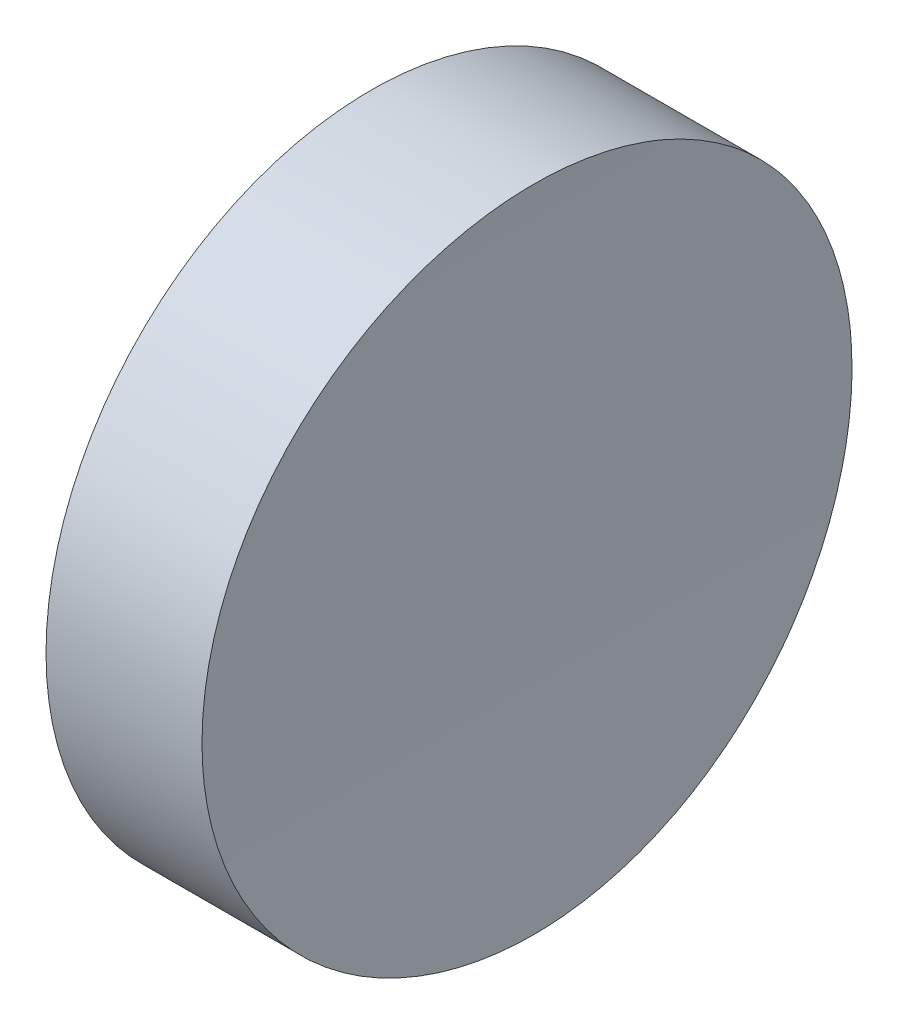
ISO-10303-21;
HEADER;
FILE_DESCRIPTION(('STEP AP214'),'2;1');
FILE_NAME('part.step','',(''),(''),'','','');
FILE_SCHEMA(('AUTOMOTIVE_DESIGN { 1 0 10303 214 1 1 1 1 }'));
ENDSEC;
DATA;
#1=APPLICATION_CONTEXT('core data for automotive mechanical design processes');
#2=APPLICATION_PROTOCOL_DEFINITION('international standard','automotive_design',2000,#1);
#3=PRODUCT_CONTEXT('',#1,'mechanical');
#4=PRODUCT('Part','Part','',(#3));
#5=PRODUCT_RELATED_PRODUCT_CATEGORY('part','',(#4));
#6=PRODUCT_DEFINITION_FORMATION('','',#4);
#7=PRODUCT_DEFINITION_CONTEXT('part definition',#1,'design');
#8=PRODUCT_DEFINITION('design','',#6,#7);
#9=PRODUCT_DEFINITION_SHAPE('','',#8);
#10=(LENGTH_UNIT() NAMED_UNIT(*) SI_UNIT(.MILLI.,.METRE.));
#11=(NAMED_UNIT(*) PLANE_ANGLE_UNIT() SI_UNIT($,.RADIAN.));
#12=(NAMED_UNIT(*) SI_UNIT($,.STERADIAN.) SOLID_ANGLE_UNIT());
#13=UNCERTAINTY_MEASURE_WITH_UNIT(LENGTH_MEASURE(1.E-05),#10,'distance_accuracy_value','');
#14=(GEOMETRIC_REPRESENTATION_CONTEXT(3) GLOBAL_UNCERTAINTY_ASSIGNED_CONTEXT((#13)) GLOBAL_UNIT_ASSIGNED_CONTEXT((#10,
#11,#12)) REPRESENTATION_CONTEXT('',''));
#15=CARTESIAN_POINT('',(0.,0.,0.));
#16=DIRECTION('',(0.,0.,1.));
#17=DIRECTION('',(1.,0.,0.));
#18=AXIS2_PLACEMENT_3D('',#15,#16,#17);
#19=CARTESIAN_POINT('',(10.,0.,0.));
#20=DIRECTION('',(-1.,0.,0.));
#21=DIRECTION('',(0.,0.,1.));
#22=AXIS2_PLACEMENT_3D('',#19,#20,#21);
#23=CYLINDRICAL_SURFACE('',#22,6.25);
#24=CARTESIAN_POINT('',(2.99999999999998,0.,6.25));
#25=CARTESIAN_POINT('',(2.99999984560543,0.17551391547614,6.25000133653329));
#26=CARTESIAN_POINT('',(3.00030869587048,0.351006181898226,6.24260377126208));
#27=CARTESIAN_POINT('',(3.00153513964791,0.700800789729959,6.21306570461797));
#28=CARTESIAN_POINT('',(3.00245289085927,0.875102811060672,6.19092138398417));
#29=CARTESIAN_POINT('',(3.00487252402975,1.22136930662903,6.13201676763915));
#30=CARTESIAN_POINT('',(3.00637491675738,1.39333160044456,6.09524369097661));
#31=CARTESIAN_POINT('',(3.00992175104011,1.73360541549669,6.00732896535061));
#32=CARTESIAN_POINT('',(3.01196639069807,1.90191557811393,5.95618206468948));
#33=CARTESIAN_POINT('',(3.01653742210598,2.23347741768185,5.83994123039431));
#34=CARTESIAN_POINT('',(3.01906339411208,2.3967333590072,5.77485944255114));
#35=CARTESIAN_POINT('',(3.02452765123682,2.71724034415452,5.63115971258989));
#36=CARTESIAN_POINT('',(3.02746608803904,2.87448915167161,5.55253678830504));
#37=CARTESIAN_POINT('',(3.03366935540421,3.18170837918246,5.38238303209557));
#38=CARTESIAN_POINT('',(3.03693398589131,3.33168317795182,5.29086009861046));
#39=CARTESIAN_POINT('',(3.04369994676879,3.62344858012132,5.09548392765871));
#40=CARTESIAN_POINT('',(3.04720136413013,3.7652361405404,4.99162614893954));
#41=CARTESIAN_POINT('',(3.05434160845807,4.03960034600061,4.77231400966161));
#42=CARTESIAN_POINT('',(3.05798047328038,4.17217442449358,4.6568564395452));
#43=CARTESIAN_POINT('',(3.06529289110243,4.42717568553201,4.41514321264936));
#44=CARTESIAN_POINT('',(3.06896645641693,4.54959910252688,4.28888358365167));
#45=CARTESIAN_POINT('',(3.07624151377952,4.78333703315302,4.02654202726747));
#46=CARTESIAN_POINT('',(3.07984302910977,4.89465518324773,3.8904633404899));
#47=CARTESIAN_POINT('',(3.08687437432033,5.10547718450432,3.60936016623274));
#48=CARTESIAN_POINT('',(3.09030414032741,5.20497665892408,3.46433239471349));
#49=CARTESIAN_POINT('',(3.09689307320452,5.39140410632779,3.16640773576138));
#50=CARTESIAN_POINT('',(3.10005224598937,5.47833235413182,3.01351102045094));
#51=CARTESIAN_POINT('',(3.10601146088755,5.63903072706564,2.70087767205642));
#52=CARTESIAN_POINT('',(3.10881136990564,5.71279597967621,2.54113853314664));
#53=CARTESIAN_POINT('',(3.11396989566231,5.84657805098931,2.2160530791498));
#54=CARTESIAN_POINT('',(3.11632867712001,5.90660000339091,2.0507088843697));
#55=CARTESIAN_POINT('',(3.12054054329838,6.01252014846919,1.71553259031182));
#56=CARTESIAN_POINT('',(3.12239344112957,6.05841312224889,1.5456988578013));
#57=CARTESIAN_POINT('',(3.12710399391013,6.17425037660026,1.03158878111233));
#58=CARTESIAN_POINT('',(3.12912245642612,6.22257739481509,0.682156806643126));
#59=CARTESIAN_POINT('',(3.13067523269733,6.25985501385608,-0.0196757421943179));
#60=CARTESIAN_POINT('',(3.13020956142888,6.24880597264817,-0.37207629865281));
#61=CARTESIAN_POINT('',(3.12685201830647,6.16775020069535,-1.06984358080579));
#62=CARTESIAN_POINT('',(3.12396165655751,6.09778016603033,-1.41521454745534));
#63=CARTESIAN_POINT('',(3.11608178355874,5.90090490318633,-2.08929064014941));
#64=CARTESIAN_POINT('',(3.11109226546329,5.77399948933279,-2.41799571184014));
#65=CARTESIAN_POINT('',(3.09957504791958,5.46681930833326,-3.04954420705071));
#66=CARTESIAN_POINT('',(3.09304686501913,5.28652776256273,-3.35237946138278));
#67=CARTESIAN_POINT('',(3.07918858729555,4.87770395742489,-3.92349804874875));
#68=CARTESIAN_POINT('',(3.07185848863925,4.64917146746023,-4.19178121660977));
#69=CARTESIAN_POINT('',(3.05721592521602,4.15014600137135,-4.68639495598233));
#70=CARTESIAN_POINT('',(3.04990347811469,3.879621223966,-4.91269344446994));
#71=CARTESIAN_POINT('',(3.03612584510675,3.30440222735998,-5.31666660642272));
#72=CARTESIAN_POINT('',(3.02966065937085,2.9997080012755,-5.49434127009209));
#73=CARTESIAN_POINT('',(3.01830607802898,2.36478094245642,-5.79602003380735));
#74=CARTESIAN_POINT('',(3.01341671375576,2.03454760207825,-5.92002306669342));
#75=CARTESIAN_POINT('',(3.00576534543038,1.35792459017983,-6.11081781932825));
#76=CARTESIAN_POINT('',(3.0030033302928,1.01153500285834,-6.17760983719876));
#77=CARTESIAN_POINT('',(2.99991939565951,0.312710874311892,-6.25204715428061));
#78=CARTESIAN_POINT('',(2.99959564503349,-0.0397189313135692,-6.25973683927934));
#79=CARTESIAN_POINT('',(3.00141987329824,-0.740864163854127,-6.21586695498812));
#80=CARTESIAN_POINT('',(3.00356784655272,-1.0895795992373,-6.16430752080433));
#81=CARTESIAN_POINT('',(3.0100923421847,-1.77327328001454,-6.00343974013424));
#82=CARTESIAN_POINT('',(3.01446808452206,-2.10825628940539,-5.89415160650705));
#83=CARTESIAN_POINT('',(3.02495526465455,-2.75512271438304,-5.62094911669629));
#84=CARTESIAN_POINT('',(3.03106670934955,-3.06700603813613,-5.45703454335738));
#85=CARTESIAN_POINT('',(3.04434190040587,-3.65902396378291,-5.07911847651543));
#86=CARTESIAN_POINT('',(3.05150627213662,-3.93913952132513,-4.86508717183888));
#87=CARTESIAN_POINT('',(3.06607809157745,-4.45947895015574,-4.39305561008465));
#88=CARTESIAN_POINT('',(3.07348554039747,-4.69970263925759,-4.13505515221034));
#89=CARTESIAN_POINT('',(3.08771379723712,-5.13358864839096,-3.58222302788612));
#90=CARTESIAN_POINT('',(3.09453424228563,-5.32722229066553,-3.28736884549809));
#91=CARTESIAN_POINT('',(3.10681356794777,-5.66223380791476,-2.66929588046843));
#92=CARTESIAN_POINT('',(3.11227245312843,-5.80361185816892,-2.34607719297358));
#93=CARTESIAN_POINT('',(3.1212112228348,-6.03005582817124,-1.68062233035818));
#94=CARTESIAN_POINT('',(3.12469175426239,-6.11514015689689,-1.33839241194752));
#95=CARTESIAN_POINT('',(3.12928064118395,-6.22661561307866,-0.644298818558869));
#96=CARTESIAN_POINT('',(3.13038900470149,-6.25300693905673,-0.292435176169859));
#97=CARTESIAN_POINT('',(3.13018552528645,-6.24808126745473,0.234456311311578));
#98=CARTESIAN_POINT('',(3.12980648861214,-6.23901568033516,0.409963628582474));
#99=CARTESIAN_POINT('',(3.12844163662777,-6.20615137423689,0.759573469571953));
#100=CARTESIAN_POINT('',(3.12745604551198,-6.18235809887841,0.933676488269091));
#101=CARTESIAN_POINT('',(3.12490458902028,-6.12019021367536,1.27930905934949));
#102=CARTESIAN_POINT('',(3.12333850880017,-6.08181020501681,1.45083763442078));
#103=CARTESIAN_POINT('',(3.11967164314843,-5.99076355695094,1.78998984787879));
#104=CARTESIAN_POINT('',(3.11757105490665,-5.93810218573047,1.95761490150733));
#105=CARTESIAN_POINT('',(3.1128935539755,-5.81883837679907,2.2878943276543));
#106=CARTESIAN_POINT('',(3.11031646034004,-5.75223064188008,2.45054678446565));
#107=CARTESIAN_POINT('',(3.10476071110139,-5.60558801671665,2.76960219070161));
#108=CARTESIAN_POINT('',(3.1017822037464,-5.52555808084113,2.92600741980804));
#109=CARTESIAN_POINT('',(3.09550631344271,-5.35259377320179,3.23157426815199));
#110=CARTESIAN_POINT('',(3.0922088242445,-5.25965509714792,3.38073344878255));
#111=CARTESIAN_POINT('',(3.08539059296975,-5.06159040825005,3.67064168103706));
#112=CARTESIAN_POINT('',(3.08186993349164,-4.9564688926508,3.81139380719823));
#113=CARTESIAN_POINT('',(3.07470033521971,-4.73464285891643,4.08369029942367));
#114=CARTESIAN_POINT('',(3.07105126901248,-4.61792661376248,4.21522510898909));
#115=CARTESIAN_POINT('',(3.06373315905846,-4.37387465227454,4.46794884966267));
#116=CARTESIAN_POINT('',(3.06006412316329,-4.2465428624095,4.58914157282354));
#117=CARTESIAN_POINT('',(3.05280650499481,-3.98204371893633,4.82044730686954));
#118=CARTESIAN_POINT('',(3.04921797368315,-3.84487035380085,4.9305534453456));
#119=CARTESIAN_POINT('',(3.04222683390585,-3.56178357410283,5.13878007760074));
#120=CARTESIAN_POINT('',(3.03882415737612,-3.41587340074805,5.23690497565954));
#121=CARTESIAN_POINT('',(3.03229594596377,-3.11612506487287,5.42062738821011));
#122=CARTESIAN_POINT('',(3.02917074255913,-2.9622777581244,5.50620999660318));
#123=CARTESIAN_POINT('',(3.02329191661572,-2.64796672674003,5.66407007255344));
#124=CARTESIAN_POINT('',(3.02053815853827,-2.4875054435697,5.73635239684763));
#125=CARTESIAN_POINT('',(3.01548136158079,-2.16119489810361,5.86707749101854));
#126=CARTESIAN_POINT('',(3.01317792852887,-1.99535049731315,5.92553237362515));
#127=CARTESIAN_POINT('',(3.0090846168256,-1.65937679586609,6.02825231618961));
#128=CARTESIAN_POINT('',(3.00729460476628,-1.48924862083196,6.0725210626428));
#129=CARTESIAN_POINT('',(3.00388710898848,-1.1012847868823,6.15618302630384));
#130=CARTESIAN_POINT('',(3.00243478207406,-0.88251983138735,6.19133387295717));
#131=CARTESIAN_POINT('',(3.00049132516323,-0.442491784537349,6.23824151068586));
#132=CARTESIAN_POINT('',(3.00000019460849,-0.221228694633449,6.24999831535002));
#133=CARTESIAN_POINT('',(2.99999999999998,0.,6.25));
#134=B_SPLINE_CURVE_WITH_KNOTS('',3,(#24,#25,#26,#27,#28,#29,#30,#31,#32,#33,#34,#35,#36,#37,
#38,#39,#40,#41,#42,#43,#44,#45,#46,#47,#48,#49,#50,#51,#52,#53,#54,#55,#56,#57,#58,#59,#60,#61,
#62,#63,#64,#65,#66,#67,#68,#69,#70,#71,#72,#73,#74,#75,#76,#77,#78,#79,#80,#81,#82,#83,#84,#85,
#86,#87,#88,#89,#90,#91,#92,#93,#94,#95,#96,#97,#98,#99,#100,#101,#102,#103,#104,#105,#106,#107,
#108,#109,#110,#111,#112,#113,#114,#115,#116,#117,#118,#119,#120,#121,#122,#123,#124,#125,#126,
#127,#128,#129,#130,#131,#132,#133),.UNSPECIFIED.,.T.,.F.,(4,2,2,2,2,2,2,2,2,2,2,2,2,2,2,2,2,2,
2,2,2,2,2,2,2,2,2,2,2,2,2,2,2,2,2,2,2,2,2,2,2,2,2,2,2,2,2,2,2,2,2,2,2,2,4),(0.,
0.526348470967113,1.05283331392268,1.57977915354543,2.10691777179953,2.63359878750176,
3.16047399962713,3.68702800586183,4.21377647507826,4.74067109434826,5.26776030717466,
5.79467635209323,6.32178692242766,6.84888596783451,7.37617972549434,7.90327619431612,
8.43056712665238,9.48339813930604,10.5362228046673,11.5883922538408,12.640565134317,
13.6930690518026,14.7455780004939,15.7988879514711,16.8521981146491,17.9055292199643,
18.958854836427,20.0113893291359,21.0639214217479,22.1160852296962,23.168253220339,
24.22104867415,25.2738489359556,26.3272955837104,27.3807386978856,28.4338371482536,
29.486932036639,30.0136448975778,30.5401631920633,31.0668765505741,31.5933958758603,
32.1201155514685,32.6466412318181,33.1733429002436,33.6998507545451,34.2268966530031,
34.7537484657736,35.2809248811467,35.8079069203609,36.3355102679231,36.8629205716346,
37.3898671428465,37.916676667273,38.580119520089,39.2435619875337),.UNSPECIFIED.);
#135=CARTESIAN_POINT('',(2.99999999999998,0.,6.25));
#136=VERTEX_POINT('',#135);
#137=EDGE_CURVE('E10',#136,#136,#134,.T.);
#138=ORIENTED_EDGE('',*,*,#137,.T.);
#139=EDGE_LOOP('',(#138));
#140=FACE_BOUND('',#139,.T.);
#141=CARTESIAN_POINT('',(0.,0.,0.));
#142=DIRECTION('',(1.,0.,0.));
#143=DIRECTION('',(0.,0.,-1.));
#144=AXIS2_PLACEMENT_3D('',#141,#142,#143);
#145=CIRCLE('',#144,6.25);
#146=CARTESIAN_POINT('',(0.,0.,-6.25));
#147=VERTEX_POINT('',#146);
#148=EDGE_CURVE('E46',#147,#147,#145,.T.);
#149=ORIENTED_EDGE('',*,*,#148,.T.);
#150=EDGE_LOOP('',(#149));
#151=FACE_BOUND('',#150,.T.);
#152=ADVANCED_FACE('F35',(#140,#151),#23,.T.);
#153=CARTESIAN_POINT('',(0.,0.,0.));
#154=DIRECTION('',(1.,0.,0.));
#155=DIRECTION('',(0.,0.,-1.));
#156=AXIS2_PLACEMENT_3D('',#153,#154,#155);
#157=PLANE('',#156);
#158=ORIENTED_EDGE('',*,*,#148,.F.);
#159=EDGE_LOOP('',(#158));
#160=FACE_BOUND('',#159,.T.);
#161=ADVANCED_FACE('F53',(#160),#157,.F.);
#162=CARTESIAN_POINT('',(153.,0.,-6.25));
#163=DIRECTION('',(0.,0.,1.));
#164=DIRECTION('',(1.,0.,0.));
#165=AXIS2_PLACEMENT_3D('',#162,#163,#164);
#166=CYLINDRICAL_SURFACE('',#165,150.);
#167=ORIENTED_EDGE('',*,*,#137,.F.);
#168=EDGE_LOOP('',(#167));
#169=FACE_BOUND('',#168,.T.);
#170=ADVANCED_FACE('F55',(#169),#166,.F.);
#171=CLOSED_SHELL('',(#152,#161,#170));
#172=MANIFOLD_SOLID_BREP('B2',#171);
#173=ADVANCED_BREP_SHAPE_REPRESENTATION('',(#18,#172),#14);
#174=SHAPE_DEFINITION_REPRESENTATION(#9,#173);
ENDSEC;
END-ISO-10303-21;
